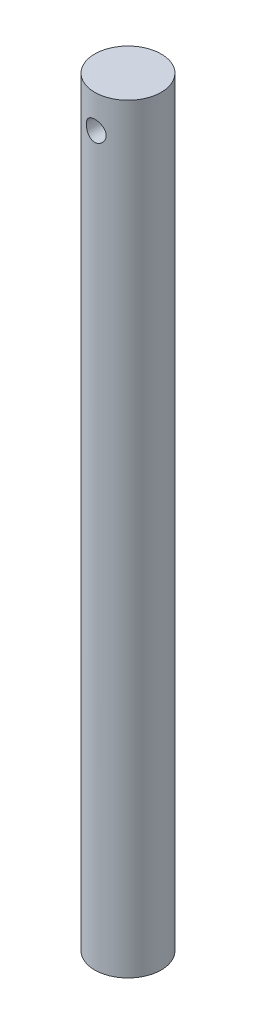
ISO-10303-21;
HEADER;
FILE_DESCRIPTION(('STEP AP214'),'2;1');
FILE_NAME('part.step','',(''),(''),'','','');
FILE_SCHEMA(('AUTOMOTIVE_DESIGN { 1 0 10303 214 1 1 1 1 }'));
ENDSEC;
DATA;
#1=APPLICATION_CONTEXT('core data for automotive mechanical design processes');
#2=APPLICATION_PROTOCOL_DEFINITION('international standard','automotive_design',2000,#1);
#3=PRODUCT_CONTEXT('',#1,'mechanical');
#4=PRODUCT('Part','Part','',(#3));
#5=PRODUCT_RELATED_PRODUCT_CATEGORY('part','',(#4));
#6=PRODUCT_DEFINITION_FORMATION('','',#4);
#7=PRODUCT_DEFINITION_CONTEXT('part definition',#1,'design');
#8=PRODUCT_DEFINITION('design','',#6,#7);
#9=PRODUCT_DEFINITION_SHAPE('','',#8);
#10=(LENGTH_UNIT() NAMED_UNIT(*) SI_UNIT(.MILLI.,.METRE.));
#11=(NAMED_UNIT(*) PLANE_ANGLE_UNIT() SI_UNIT($,.RADIAN.));
#12=(NAMED_UNIT(*) SI_UNIT($,.STERADIAN.) SOLID_ANGLE_UNIT());
#13=UNCERTAINTY_MEASURE_WITH_UNIT(LENGTH_MEASURE(1.E-05),#10,'distance_accuracy_value','');
#14=(GEOMETRIC_REPRESENTATION_CONTEXT(3) GLOBAL_UNCERTAINTY_ASSIGNED_CONTEXT((#13)) GLOBAL_UNIT_ASSIGNED_CONTEXT((#10,
#11,#12)) REPRESENTATION_CONTEXT('',''));
#15=CARTESIAN_POINT('',(0.,0.,0.));
#16=DIRECTION('',(0.,0.,1.));
#17=DIRECTION('',(1.,0.,0.));
#18=AXIS2_PLACEMENT_3D('',#15,#16,#17);
#19=CARTESIAN_POINT('',(0.,228.6,0.));
#20=DIRECTION('',(0.,-1.,0.));
#21=DIRECTION('',(0.,0.,-1.));
#22=AXIS2_PLACEMENT_3D('',#19,#20,#21);
#23=CYLINDRICAL_SURFACE('',#22,9.9949);
#24=CARTESIAN_POINT('',(0.,221.5896,-9.9949));
#25=CARTESIAN_POINT('',(-0.16442684298399,221.589597998131,-9.99489858087109));
#26=CARTESIAN_POINT('',(-0.328873941601209,221.576024419951,-9.99080371240926));
#27=CARTESIAN_POINT('',(-0.652979511357908,221.52221748529,-9.97486852417241));
#28=CARTESIAN_POINT('',(-0.812636535845261,221.481976157927,-9.96302588863465));
#29=CARTESIAN_POINT('',(-1.12244035699956,221.376297982412,-9.9328928247996));
#30=CARTESIAN_POINT('',(-1.27260079914968,221.310898287897,-9.91461190784244));
#31=CARTESIAN_POINT('',(-1.55982435941824,221.15691213085,-9.87350249880839));
#32=CARTESIAN_POINT('',(-1.69688573519602,221.068322589621,-9.85067340300872));
#33=CARTESIAN_POINT('',(-1.95795263235336,220.867793591909,-9.80217048740567));
#34=CARTESIAN_POINT('',(-2.08152932134505,220.755309969661,-9.7764384069793));
#35=CARTESIAN_POINT('',(-2.30837799378338,220.511345628808,-9.72537734991289));
#36=CARTESIAN_POINT('',(-2.4116465640126,220.379861723228,-9.70004844169098));
#37=CARTESIAN_POINT('',(-2.59720361094302,220.098001419707,-9.65204523731163));
#38=CARTESIAN_POINT('',(-2.67896877768402,219.9472670221,-9.62944334140301));
#39=CARTESIAN_POINT('',(-2.81581515849115,219.633400433198,-9.59032391952106));
#40=CARTESIAN_POINT('',(-2.87090277419694,219.470271227085,-9.57380493409917));
#41=CARTESIAN_POINT('',(-2.95128419701179,219.141060745952,-9.54932878749753));
#42=CARTESIAN_POINT('',(-2.97736853112856,218.975189790997,-9.54114499221537));
#43=CARTESIAN_POINT('',(-3.0014714369832,218.641239682755,-9.53359161589373));
#44=CARTESIAN_POINT('',(-2.99949680228921,218.473161073826,-9.53421990129459));
#45=CARTESIAN_POINT('',(-2.96815877752675,218.14599451393,-9.54401882935443));
#46=CARTESIAN_POINT('',(-2.93978566726014,217.986800924793,-9.55288059467273));
#47=CARTESIAN_POINT('',(-2.8580560135557,217.675546052717,-9.57764830395428));
#48=CARTESIAN_POINT('',(-2.80469700637537,217.523485474758,-9.59355494257117));
#49=CARTESIAN_POINT('',(-2.67378048751326,217.228390215183,-9.63086672733749));
#50=CARTESIAN_POINT('',(-2.59590169818158,217.085507596956,-9.65234416699735));
#51=CARTESIAN_POINT('',(-2.41837961838716,216.814507136893,-9.6983428211435));
#52=CARTESIAN_POINT('',(-2.31873105718593,216.686392882162,-9.72286477212291));
#53=CARTESIAN_POINT('',(-2.09557934498604,216.44294906376,-9.77344224359761));
#54=CARTESIAN_POINT('',(-1.97125436817669,216.328375953041,-9.79951906086264));
#55=CARTESIAN_POINT('',(-1.70483075153731,216.121529163998,-9.849361371147));
#56=CARTESIAN_POINT('',(-1.56273099572517,216.029256886889,-9.873126718875));
#57=CARTESIAN_POINT('',(-1.26341746982466,215.869172207907,-9.91588511821337));
#58=CARTESIAN_POINT('',(-1.10610898283771,215.801527502291,-9.93484519339709));
#59=CARTESIAN_POINT('',(-0.781647618707577,215.693878295851,-9.96561909978023));
#60=CARTESIAN_POINT('',(-0.614497499077755,215.653866092336,-9.97743492236));
#61=CARTESIAN_POINT('',(-0.281528534607556,215.603876786605,-9.9922740874606));
#62=CARTESIAN_POINT('',(-0.115876749002344,215.592874451727,-9.99559742485153));
#63=CARTESIAN_POINT('',(0.214916989810312,215.598343781687,-9.99395722435403));
#64=CARTESIAN_POINT('',(0.380059008070564,215.614811782335,-9.98899479168043));
#65=CARTESIAN_POINT('',(0.701276680789801,215.673925308989,-9.97153699772691));
#66=CARTESIAN_POINT('',(0.857472823819491,215.715971871439,-9.95921410990189));
#67=CARTESIAN_POINT('',(1.16055951414517,215.824328430166,-9.92846171034988));
#68=CARTESIAN_POINT('',(1.30744894074096,215.89064134207,-9.91003146484297));
#69=CARTESIAN_POINT('',(1.5915256128231,216.047369946027,-9.86844325400058));
#70=CARTESIAN_POINT('',(1.72840999712303,216.138307485203,-9.84518582849695));
#71=CARTESIAN_POINT('',(1.98532501626533,216.34106972648,-9.7966133840772));
#72=CARTESIAN_POINT('',(2.10535141678262,216.452899659877,-9.7712978507253));
#73=CARTESIAN_POINT('',(2.32965675013691,216.699088839287,-9.7203112387702));
#74=CARTESIAN_POINT('',(2.43320630832081,216.834118297033,-9.69466058669442));
#75=CARTESIAN_POINT('',(2.6162275791249,217.120194313019,-9.64688333981351));
#76=CARTESIAN_POINT('',(2.69569992531369,217.271240449654,-9.62475665228593));
#77=CARTESIAN_POINT('',(2.8277670179081,217.584580153937,-9.58678718947881));
#78=CARTESIAN_POINT('',(2.88048714296747,217.746817129459,-9.57091518037235));
#79=CARTESIAN_POINT('',(2.95770172631096,218.078430701162,-9.54733930963211));
#80=CARTESIAN_POINT('',(2.98220584694818,218.247804832671,-9.53963265190896));
#81=CARTESIAN_POINT('',(3.00163637229922,218.58130810317,-9.53353533998712));
#82=CARTESIAN_POINT('',(2.99775170444714,218.745362032339,-9.53477019327896));
#83=CARTESIAN_POINT('',(2.96335257746519,219.070363557825,-9.54551648645263));
#84=CARTESIAN_POINT('',(2.9328391830269,219.231311278075,-9.55502759542638));
#85=CARTESIAN_POINT('',(2.84681595546194,219.543589856533,-9.58100364226944));
#86=CARTESIAN_POINT('',(2.79162067623233,219.695015196045,-9.59738091638628));
#87=CARTESIAN_POINT('',(2.658045369549,219.986577016794,-9.63522795606684));
#88=CARTESIAN_POINT('',(2.57966090745515,220.126711332238,-9.65669869553613));
#89=CARTESIAN_POINT('',(2.39859113840193,220.397231033556,-9.70328890761621));
#90=CARTESIAN_POINT('',(2.29512513778803,220.527075886912,-9.72851274615022));
#91=CARTESIAN_POINT('',(2.06823484121448,220.767945647025,-9.77925990278095));
#92=CARTESIAN_POINT('',(1.94480536841877,220.878965656873,-9.80478329696059));
#93=CARTESIAN_POINT('',(1.67715067360337,221.08226488957,-9.85414729951976));
#94=CARTESIAN_POINT('',(1.53242343607487,221.173902183212,-9.87791700349054));
#95=CARTESIAN_POINT('',(1.22890356266907,221.331415140482,-9.92024395444393));
#96=CARTESIAN_POINT('',(1.07011755847266,221.397302871898,-9.93880364200073));
#97=CARTESIAN_POINT('',(0.760603073441884,221.495529162443,-9.96699631681891));
#98=CARTESIAN_POINT('',(0.610839797881182,221.530710177143,-9.97737376515099));
#99=CARTESIAN_POINT('',(0.307389808955361,221.577744585926,-9.9913257026286));
#100=CARTESIAN_POINT('',(0.153703754397658,221.589601871317,-9.99490132658048));
#101=CARTESIAN_POINT('',(0.,221.5896,-9.9949));
#102=B_SPLINE_CURVE_WITH_KNOTS('',3,(#24,#25,#26,#27,#28,#29,#30,#31,#32,#33,#34,#35,#36,#37,
#38,#39,#40,#41,#42,#43,#44,#45,#46,#47,#48,#49,#50,#51,#52,#53,#54,#55,#56,#57,#58,#59,#60,#61,
#62,#63,#64,#65,#66,#67,#68,#69,#70,#71,#72,#73,#74,#75,#76,#77,#78,#79,#80,#81,#82,#83,#84,#85,
#86,#87,#88,#89,#90,#91,#92,#93,#94,#95,#96,#97,#98,#99,#100,#101),.UNSPECIFIED.,.T.,.F.,(4,2,2,
2,2,2,2,2,2,2,2,2,2,2,2,2,2,2,2,2,2,2,2,2,2,2,2,2,2,2,2,2,2,2,2,2,2,2,4),(0.,0.492715943924644,
0.985579225118158,1.47771742753045,1.96992099967514,2.47484195027415,2.97984769133751,
3.49619592174448,4.01242018592874,4.51420004571544,5.015858417874,5.49942564768715,
5.98304056984833,6.47327619008386,6.96363063439441,7.47444444787528,7.98529034870171,
8.49955241576373,9.01367107187622,9.50936048813476,10.004983791101,10.4894255168657,
10.9739254679042,11.4696279186714,11.9654546563037,12.479271471351,12.9930747646302,
13.5044472642064,14.0156445960872,14.5055594064386,14.9954546295118,15.4792769339165,
15.96319182314,16.4647211929473,16.9663808261823,17.4826896789657,17.9987562674751,
18.4594166276644,18.9200001252152),.UNSPECIFIED.);
#103=CARTESIAN_POINT('',(0.,221.5896,-9.9949));
#104=VERTEX_POINT('',#103);
#105=EDGE_CURVE('E10',#104,#104,#102,.T.);
#106=ORIENTED_EDGE('',*,*,#105,.T.);
#107=EDGE_LOOP('',(#106));
#108=FACE_BOUND('',#107,.T.);
#109=CARTESIAN_POINT('',(2.9972,218.5924,9.53492622782159));
#110=CARTESIAN_POINT('',(2.99719794571829,218.428160795761,9.53492793280023));
#111=CARTESIAN_POINT('',(2.98365423307907,218.26390126482,9.53921619582068));
#112=CARTESIAN_POINT('',(2.92997666983017,217.940184242528,9.55583744560146));
#113=CARTESIAN_POINT('',(2.889833917451,217.780728377482,9.56817312552976));
#114=CARTESIAN_POINT('',(2.784443668721,217.471351961766,9.59936917935017));
#115=CARTESIAN_POINT('',(2.71923790055679,217.321416041965,9.61821870290596));
#116=CARTESIAN_POINT('',(2.56570965538061,217.034574898563,9.66030389008638));
#117=CARTESIAN_POINT('',(2.4773837241305,216.897671626259,9.68354020896976));
#118=CARTESIAN_POINT('',(2.27713217646146,216.636452902669,9.73260486600448));
#119=CARTESIAN_POINT('',(2.16460295871828,216.512610432959,9.7584883905919));
#120=CARTESIAN_POINT('',(1.92043267052248,216.285241280478,9.80945958418983));
#121=CARTESIAN_POINT('',(1.78878914922247,216.181717206952,9.8345471506387));
#122=CARTESIAN_POINT('',(1.50676276063952,215.995869951499,9.88172655501062));
#123=CARTESIAN_POINT('',(1.3560489230281,215.914028978444,9.90374579122349));
#124=CARTESIAN_POINT('',(1.0422251266608,215.777037050031,9.94166641531708));
#125=CARTESIAN_POINT('',(0.879117847758532,215.721880343586,9.95756912130208));
#126=CARTESIAN_POINT('',(0.550085400517267,215.641387764346,9.98107439758818));
#127=CARTESIAN_POINT('',(0.384374041056853,215.615244566414,9.98890122350711));
#128=CARTESIAN_POINT('',(0.0507446907015113,215.590968388588,9.99616259272994));
#129=CARTESIAN_POINT('',(-0.117172829704446,215.592829530303,9.99559889728853));
#130=CARTESIAN_POINT('',(-0.444784300474384,215.62396719814,9.98630127480786));
#131=CARTESIAN_POINT('',(-0.6045699044514,215.65236946202,9.97782790133125));
#132=CARTESIAN_POINT('',(-0.916992583381413,215.734355085173,9.95397963437487));
#133=CARTESIAN_POINT('',(-1.06962920510459,215.787940038605,9.93860430397843));
#134=CARTESIAN_POINT('',(-1.36549995286965,215.919362266936,9.90231940185882));
#135=CARTESIAN_POINT('',(-1.50860394087418,215.997474600516,9.88134748984467));
#136=CARTESIAN_POINT('',(-1.77995271258828,216.175516693696,9.83609400730122));
#137=CARTESIAN_POINT('',(-1.90819396236297,216.275451625863,9.81181165261793));
#138=CARTESIAN_POINT('',(-2.15139426377635,216.498836685384,9.7614320965833));
#139=CARTESIAN_POINT('',(-2.2656514654951,216.623044292209,9.73530101711013));
#140=CARTESIAN_POINT('',(-2.47191305204416,216.889111727968,9.68498699543894));
#141=CARTESIAN_POINT('',(-2.56391522933647,217.030973305937,9.66080424665982));
#142=CARTESIAN_POINT('',(-2.7237863402352,217.330168451635,9.61696319064409));
#143=CARTESIAN_POINT('',(-2.79141579152503,217.487637143765,9.59735041657235));
#144=CARTESIAN_POINT('',(-2.89898853528615,217.81245333719,9.56541041304228));
#145=CARTESIAN_POINT('',(-2.93894085069857,217.979797599655,9.55308080941241));
#146=CARTESIAN_POINT('',(-2.98871369828877,218.3129354407,9.53762415943319));
#147=CARTESIAN_POINT('',(-2.9996010271651,218.478554652333,9.53417147957845));
#148=CARTESIAN_POINT('',(-2.99391377455864,218.809258374797,9.53595920588732));
#149=CARTESIAN_POINT('',(-2.97734303333595,218.974342957165,9.54119839641415));
#150=CARTESIAN_POINT('',(-2.91816003264667,219.294842846037,9.55945996273733));
#151=CARTESIAN_POINT('',(-2.8762347092137,219.450397901873,9.57227683683488));
#152=CARTESIAN_POINT('',(-2.7683290867618,219.752255144402,9.60403677186795));
#153=CARTESIAN_POINT('',(-2.70234507577444,219.898555899177,9.62298077809589));
#154=CARTESIAN_POINT('',(-2.54617106574866,220.182090809387,9.66549209073185));
#155=CARTESIAN_POINT('',(-2.4553793034864,220.318976544886,9.68916977118687));
#156=CARTESIAN_POINT('',(-2.25288179885987,220.575959403815,9.73824337171042));
#157=CARTESIAN_POINT('',(-2.14117105498554,220.696052500281,9.76363970176086));
#158=CARTESIAN_POINT('',(-1.8949915105132,220.920706484558,9.81444792509988));
#159=CARTESIAN_POINT('',(-1.75982344809421,221.024511024167,9.83982430209324));
#160=CARTESIAN_POINT('',(-1.47338205096479,221.207982861327,9.88676907455706));
#161=CARTESIAN_POINT('',(-1.32210951708198,221.287651358335,9.90833765923609));
#162=CARTESIAN_POINT('',(-1.0087535588643,221.419821048016,9.94510494439463));
#163=CARTESIAN_POINT('',(-0.846761588967989,221.472525207047,9.96035106542677));
#164=CARTESIAN_POINT('',(-0.515680907412847,221.549789830611,9.98296497055234));
#165=CARTESIAN_POINT('',(-0.34659423867848,221.574358339952,9.99033500660966));
#166=CARTESIAN_POINT('',(-0.0131140247067268,221.594042880283,9.99622936683349));
#167=CARTESIAN_POINT('',(0.15120975481089,221.590255826435,9.99508314988318));
#168=CARTESIAN_POINT('',(0.476777804501486,221.555958685718,9.98485017498632));
#169=CARTESIAN_POINT('',(0.63802224849897,221.525450111828,9.97576386660958));
#170=CARTESIAN_POINT('',(0.951171333871952,221.439254554857,9.95076543674387));
#171=CARTESIAN_POINT('',(1.10315757601555,221.383841025615,9.93492754174808));
#172=CARTESIAN_POINT('',(1.39575481846892,221.249653148999,9.89806368240138));
#173=CARTESIAN_POINT('',(1.53636394551103,221.170874964506,9.87703686598176));
#174=CARTESIAN_POINT('',(1.80710262979837,220.989273161291,9.83116840610788));
#175=CARTESIAN_POINT('',(1.9367532964733,220.885761186341,9.80622627536802));
#176=CARTESIAN_POINT('',(2.17721110107329,220.658870037632,9.75566016213013));
#177=CARTESIAN_POINT('',(2.28801279477581,220.535485143866,9.73003598509709));
#178=CARTESIAN_POINT('',(2.49094028141121,220.267942050496,9.68010884486464));
#179=CARTESIAN_POINT('',(2.58241185091724,220.123274756666,9.65586792860669));
#180=CARTESIAN_POINT('',(2.73962938323571,219.819913992006,9.61244754471584));
#181=CARTESIAN_POINT('',(2.80538772646736,219.661227316468,9.59326564271762));
#182=CARTESIAN_POINT('',(2.90337683735732,219.352009017536,9.5640344028703));
#183=CARTESIAN_POINT('',(2.93846362639192,219.202450341816,9.55322195690563));
#184=CARTESIAN_POINT('',(2.98537384082869,218.8993998345,9.53866777983388));
#185=CARTESIAN_POINT('',(2.99720192006722,218.745908795959,9.53492463423606));
#186=CARTESIAN_POINT('',(2.9972,218.5924,9.53492622782159));
#187=B_SPLINE_CURVE_WITH_KNOTS('',3,(#109,#110,#111,#112,#113,#114,#115,#116,#117,#118,#119,
#120,#121,#122,#123,#124,#125,#126,#127,#128,#129,#130,#131,#132,#133,#134,#135,#136,#137,#138,
#139,#140,#141,#142,#143,#144,#145,#146,#147,#148,#149,#150,#151,#152,#153,#154,#155,#156,#157,
#158,#159,#160,#161,#162,#163,#164,#165,#166,#167,#168,#169,#170,#171,#172,#173,#174,#175,#176,
#177,#178,#179,#180,#181,#182,#183,#184,#185,#186),.UNSPECIFIED.,.T.,.F.,(4,2,2,2,2,2,2,2,2,2,2,
2,2,2,2,2,2,2,2,2,2,2,2,2,2,2,2,2,2,2,2,2,2,2,2,2,2,2,4),(0.,0.492151346365951,
0.984467481840859,1.4759674708864,1.96754093380773,2.47319718774647,2.97891833458046,
3.4950878925571,4.0111461542615,4.51245356254416,5.01365574285154,5.49890930059679,
5.98419358082771,6.47512703127229,6.96617697323045,7.47614081294816,7.98615521667885,
8.5010524507693,9.01578174564269,9.51134070828789,10.0068303683678,10.4894620744095,
10.9721682762965,11.4678211663348,11.9635927134596,12.4780568001175,12.9924953159404,
13.5030023643218,14.0133634072595,14.5040864490473,14.9947817077832,15.4802160428886,
15.9657301438903,16.4667697418124,16.9679538121489,17.4840589956567,17.9999153776574,
18.4600045642815,18.9200016822669),.UNSPECIFIED.);
#188=CARTESIAN_POINT('',(2.9972,218.5924,9.53492622782159));
#189=VERTEX_POINT('',#188);
#190=EDGE_CURVE('E49',#189,#189,#187,.T.);
#191=ORIENTED_EDGE('',*,*,#190,.T.);
#192=EDGE_LOOP('',(#191));
#193=FACE_BOUND('',#192,.T.);
#194=CARTESIAN_POINT('',(0.,228.6,0.));
#195=DIRECTION('',(0.,1.,0.));
#196=DIRECTION('',(0.,0.,1.));
#197=AXIS2_PLACEMENT_3D('',#194,#195,#196);
#198=CIRCLE('',#197,9.9949);
#199=CARTESIAN_POINT('',(0.,228.6,9.9949));
#200=VERTEX_POINT('',#199);
#201=EDGE_CURVE('E54',#200,#200,#198,.T.);
#202=ORIENTED_EDGE('',*,*,#201,.F.);
#203=EDGE_LOOP('',(#202));
#204=FACE_BOUND('',#203,.T.);
#205=CARTESIAN_POINT('',(0.,0.,0.));
#206=DIRECTION('',(0.,1.,0.));
#207=DIRECTION('',(0.,0.,1.));
#208=AXIS2_PLACEMENT_3D('',#205,#206,#207);
#209=CIRCLE('',#208,9.9949);
#210=CARTESIAN_POINT('',(0.,0.,9.9949));
#211=VERTEX_POINT('',#210);
#212=EDGE_CURVE('E59',#211,#211,#209,.T.);
#213=ORIENTED_EDGE('',*,*,#212,.T.);
#214=EDGE_LOOP('',(#213));
#215=FACE_BOUND('',#214,.T.);
#216=ADVANCED_FACE('F37',(#108,#193,#204,#215),#23,.T.);
#217=CARTESIAN_POINT('',(0.,228.6,0.));
#218=DIRECTION('',(0.,1.,0.));
#219=DIRECTION('',(0.,0.,1.));
#220=AXIS2_PLACEMENT_3D('',#217,#218,#219);
#221=PLANE('',#220);
#222=ORIENTED_EDGE('',*,*,#201,.T.);
#223=EDGE_LOOP('',(#222));
#224=FACE_BOUND('',#223,.T.);
#225=ADVANCED_FACE('F71',(#224),#221,.T.);
#226=CARTESIAN_POINT('',(0.,0.,0.));
#227=DIRECTION('',(0.,1.,0.));
#228=DIRECTION('',(0.,0.,1.));
#229=AXIS2_PLACEMENT_3D('',#226,#227,#228);
#230=PLANE('',#229);
#231=ORIENTED_EDGE('',*,*,#212,.F.);
#232=EDGE_LOOP('',(#231));
#233=FACE_BOUND('',#232,.T.);
#234=ADVANCED_FACE('F69',(#233),#230,.F.);
#235=CARTESIAN_POINT('',(0.,218.5924,-9.9949));
#236=DIRECTION('',(0.,0.,1.));
#237=DIRECTION('',(1.,0.,0.));
#238=AXIS2_PLACEMENT_3D('',#235,#236,#237);
#239=CYLINDRICAL_SURFACE('',#238,2.9972);
#240=ORIENTED_EDGE('',*,*,#190,.F.);
#241=EDGE_LOOP('',(#240));
#242=FACE_BOUND('',#241,.T.);
#243=ORIENTED_EDGE('',*,*,#105,.F.);
#244=EDGE_LOOP('',(#243));
#245=FACE_BOUND('',#244,.T.);
#246=ADVANCED_FACE('F65',(#242,#245),#239,.F.);
#247=CLOSED_SHELL('',(#216,#225,#234,#246));
#248=MANIFOLD_SOLID_BREP('B2',#247);
#249=ADVANCED_BREP_SHAPE_REPRESENTATION('',(#18,#248),#14);
#250=SHAPE_DEFINITION_REPRESENTATION(#9,#249);
ENDSEC;
END-ISO-10303-21;
